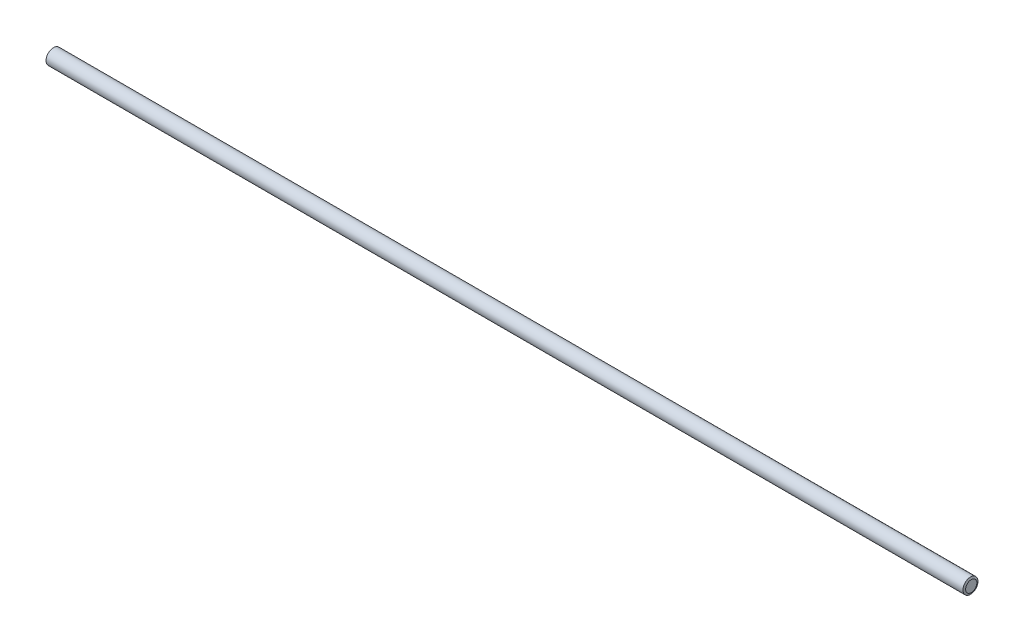
ISO-10303-21;
HEADER;
FILE_DESCRIPTION(('STEP AP214'),'2;1');
FILE_NAME('part.step','',(''),(''),'','','');
FILE_SCHEMA(('AUTOMOTIVE_DESIGN { 1 0 10303 214 1 1 1 1 }'));
ENDSEC;
DATA;
#1=APPLICATION_CONTEXT('core data for automotive mechanical design processes');
#2=APPLICATION_PROTOCOL_DEFINITION('international standard','automotive_design',2000,#1);
#3=PRODUCT_CONTEXT('',#1,'mechanical');
#4=PRODUCT('Part','Part','',(#3));
#5=PRODUCT_RELATED_PRODUCT_CATEGORY('part','',(#4));
#6=PRODUCT_DEFINITION_FORMATION('','',#4);
#7=PRODUCT_DEFINITION_CONTEXT('part definition',#1,'design');
#8=PRODUCT_DEFINITION('design','',#6,#7);
#9=PRODUCT_DEFINITION_SHAPE('','',#8);
#10=(LENGTH_UNIT() NAMED_UNIT(*) SI_UNIT(.MILLI.,.METRE.));
#11=(NAMED_UNIT(*) PLANE_ANGLE_UNIT() SI_UNIT($,.RADIAN.));
#12=(NAMED_UNIT(*) SI_UNIT($,.STERADIAN.) SOLID_ANGLE_UNIT());
#13=UNCERTAINTY_MEASURE_WITH_UNIT(LENGTH_MEASURE(1.E-05),#10,'distance_accuracy_value','');
#14=(GEOMETRIC_REPRESENTATION_CONTEXT(3) GLOBAL_UNCERTAINTY_ASSIGNED_CONTEXT((#13)) GLOBAL_UNIT_ASSIGNED_CONTEXT((#10,
#11,#12)) REPRESENTATION_CONTEXT('',''));
#15=CARTESIAN_POINT('',(0.,0.,0.));
#16=DIRECTION('',(0.,0.,1.));
#17=DIRECTION('',(1.,0.,0.));
#18=AXIS2_PLACEMENT_3D('',#15,#16,#17);
#19=CARTESIAN_POINT('',(0.,0.,0.));
#20=DIRECTION('',(1.,0.,0.));
#21=DIRECTION('',(0.,0.,-1.));
#22=AXIS2_PLACEMENT_3D('',#19,#20,#21);
#23=PLANE('',#22);
#24=CARTESIAN_POINT('',(0.,0.,0.));
#25=DIRECTION('',(-1.,0.,0.));
#26=DIRECTION('',(0.,0.,1.));
#27=AXIS2_PLACEMENT_3D('',#24,#25,#26);
#28=CIRCLE('',#27,3.73694599963691);
#29=CARTESIAN_POINT('',(0.,0.,3.73694599963691));
#30=VERTEX_POINT('',#29);
#31=EDGE_CURVE('E10',#30,#30,#28,.T.);
#32=ORIENTED_EDGE('',*,*,#31,.T.);
#33=EDGE_LOOP('',(#32));
#34=FACE_BOUND('',#33,.T.);
#35=ADVANCED_FACE('F30',(#34),#23,.F.);
#36=CARTESIAN_POINT('',(0.500000000000056,0.,0.));
#37=DIRECTION('',(1.,0.,0.));
#38=DIRECTION('',(0.,0.,-1.));
#39=AXIS2_PLACEMENT_3D('',#36,#37,#38);
#40=CONICAL_SURFACE('',#39,4.99999999999992,1.19385890747483);
#41=ORIENTED_EDGE('',*,*,#31,.F.);
#42=EDGE_LOOP('',(#41));
#43=FACE_BOUND('',#42,.T.);
#44=CARTESIAN_POINT('',(0.500000000000056,0.,0.));
#45=DIRECTION('',(-1.,0.,0.));
#46=DIRECTION('',(0.,0.,1.));
#47=AXIS2_PLACEMENT_3D('',#44,#45,#46);
#48=CIRCLE('',#47,4.99999999999992);
#49=CARTESIAN_POINT('',(0.500000000000056,0.,4.99999999999992));
#50=VERTEX_POINT('',#49);
#51=EDGE_CURVE('E36',#50,#50,#48,.T.);
#52=ORIENTED_EDGE('',*,*,#51,.T.);
#53=EDGE_LOOP('',(#52));
#54=FACE_BOUND('',#53,.T.);
#55=ADVANCED_FACE('F62',(#43,#54),#40,.T.);
#56=CARTESIAN_POINT('',(610.,0.,0.));
#57=DIRECTION('',(-1.,0.,0.));
#58=DIRECTION('',(0.,0.,1.));
#59=AXIS2_PLACEMENT_3D('',#56,#57,#58);
#60=CYLINDRICAL_SURFACE('',#59,4.99999999999992);
#61=ORIENTED_EDGE('',*,*,#51,.F.);
#62=EDGE_LOOP('',(#61));
#63=FACE_BOUND('',#62,.T.);
#64=CARTESIAN_POINT('',(609.5,0.,0.));
#65=DIRECTION('',(-1.,0.,0.));
#66=DIRECTION('',(0.,0.,1.));
#67=AXIS2_PLACEMENT_3D('',#64,#65,#66);
#68=CIRCLE('',#67,4.99999999999992);
#69=CARTESIAN_POINT('',(609.5,0.,4.99999999999992));
#70=VERTEX_POINT('',#69);
#71=EDGE_CURVE('E40',#70,#70,#68,.T.);
#72=ORIENTED_EDGE('',*,*,#71,.T.);
#73=EDGE_LOOP('',(#72));
#74=FACE_BOUND('',#73,.T.);
#75=ADVANCED_FACE('F58',(#63,#74),#60,.T.);
#76=CARTESIAN_POINT('',(610.,0.,0.));
#77=DIRECTION('',(-1.,0.,0.));
#78=DIRECTION('',(0.,0.,1.));
#79=AXIS2_PLACEMENT_3D('',#76,#77,#78);
#80=CONICAL_SURFACE('',#79,3.73694599963691,1.19385890747483);
#81=ORIENTED_EDGE('',*,*,#71,.F.);
#82=EDGE_LOOP('',(#81));
#83=FACE_BOUND('',#82,.T.);
#84=CARTESIAN_POINT('',(610.,0.,0.));
#85=DIRECTION('',(-1.,0.,0.));
#86=DIRECTION('',(0.,0.,1.));
#87=AXIS2_PLACEMENT_3D('',#84,#85,#86);
#88=CIRCLE('',#87,3.73694599963691);
#89=CARTESIAN_POINT('',(610.,0.,3.73694599963691));
#90=VERTEX_POINT('',#89);
#91=EDGE_CURVE('E44',#90,#90,#88,.T.);
#92=ORIENTED_EDGE('',*,*,#91,.T.);
#93=EDGE_LOOP('',(#92));
#94=FACE_BOUND('',#93,.T.);
#95=ADVANCED_FACE('F50',(#83,#94),#80,.T.);
#96=CARTESIAN_POINT('',(610.,3.73694599963691,0.));
#97=DIRECTION('',(-1.,0.,0.));
#98=DIRECTION('',(0.,0.,1.));
#99=AXIS2_PLACEMENT_3D('',#96,#97,#98);
#100=PLANE('',#99);
#101=ORIENTED_EDGE('',*,*,#91,.F.);
#102=EDGE_LOOP('',(#101));
#103=FACE_BOUND('',#102,.T.);
#104=ADVANCED_FACE('F52',(#103),#100,.F.);
#105=CLOSED_SHELL('',(#35,#55,#75,#95,#104));
#106=MANIFOLD_SOLID_BREP('B2',#105);
#107=ADVANCED_BREP_SHAPE_REPRESENTATION('',(#18,#106),#14);
#108=SHAPE_DEFINITION_REPRESENTATION(#9,#107);
ENDSEC;
END-ISO-10303-21;
